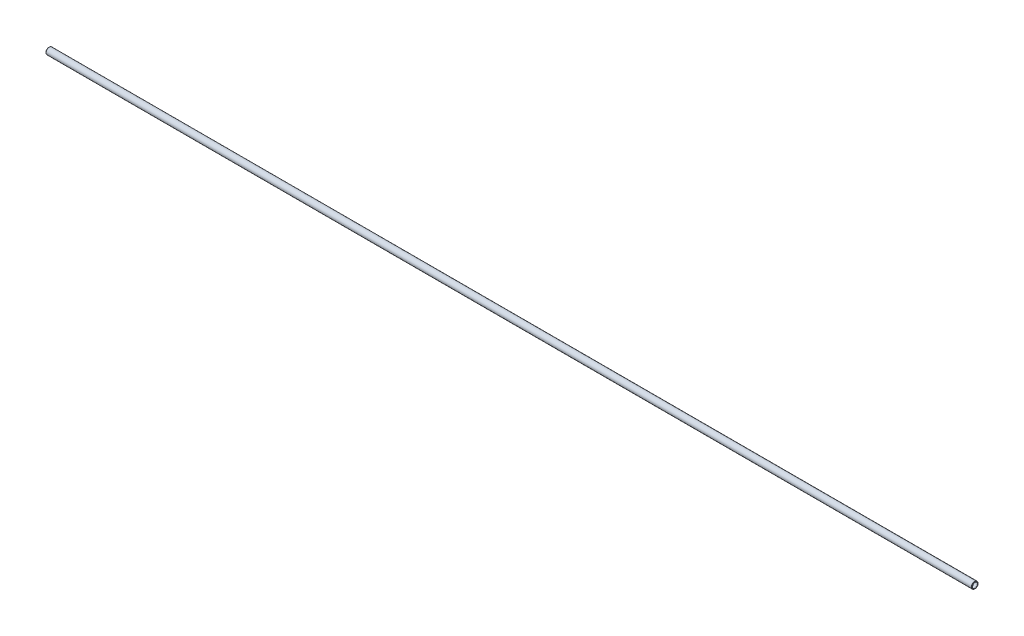
ISO-10303-21;
HEADER;
FILE_DESCRIPTION(('STEP AP214'),'2;1');
FILE_NAME('part.step','',(''),(''),'','','');
FILE_SCHEMA(('AUTOMOTIVE_DESIGN { 1 0 10303 214 1 1 1 1 }'));
ENDSEC;
DATA;
#1=APPLICATION_CONTEXT('core data for automotive mechanical design processes');
#2=APPLICATION_PROTOCOL_DEFINITION('international standard','automotive_design',2000,#1);
#3=PRODUCT_CONTEXT('',#1,'mechanical');
#4=PRODUCT('Part','Part','',(#3));
#5=PRODUCT_RELATED_PRODUCT_CATEGORY('part','',(#4));
#6=PRODUCT_DEFINITION_FORMATION('','',#4);
#7=PRODUCT_DEFINITION_CONTEXT('part definition',#1,'design');
#8=PRODUCT_DEFINITION('design','',#6,#7);
#9=PRODUCT_DEFINITION_SHAPE('','',#8);
#10=(LENGTH_UNIT() NAMED_UNIT(*) SI_UNIT(.MILLI.,.METRE.));
#11=(NAMED_UNIT(*) PLANE_ANGLE_UNIT() SI_UNIT($,.RADIAN.));
#12=(NAMED_UNIT(*) SI_UNIT($,.STERADIAN.) SOLID_ANGLE_UNIT());
#13=UNCERTAINTY_MEASURE_WITH_UNIT(LENGTH_MEASURE(1.E-05),#10,'distance_accuracy_value','');
#14=(GEOMETRIC_REPRESENTATION_CONTEXT(3) GLOBAL_UNCERTAINTY_ASSIGNED_CONTEXT((#13)) GLOBAL_UNIT_ASSIGNED_CONTEXT((#10,
#11,#12)) REPRESENTATION_CONTEXT('',''));
#15=CARTESIAN_POINT('',(0.,0.,0.));
#16=DIRECTION('',(0.,0.,1.));
#17=DIRECTION('',(1.,0.,0.));
#18=AXIS2_PLACEMENT_3D('',#15,#16,#17);
#19=CARTESIAN_POINT('',(-0.355226146905763,0.,0.));
#20=DIRECTION('',(-1.,0.,0.));
#21=DIRECTION('',(0.,0.,1.));
#22=AXIS2_PLACEMENT_3D('',#19,#20,#21);
#23=TOROIDAL_SURFACE('',#22,3.77968126932705,0.126999999999896);
#24=CARTESIAN_POINT('',(-0.445028708116357,0.,0.));
#25=DIRECTION('',(-1.,0.,0.));
#26=DIRECTION('',(0.,0.,1.));
#27=AXIS2_PLACEMENT_3D('',#24,#25,#26);
#28=CIRCLE('',#27,3.6898787081164);
#29=CARTESIAN_POINT('',(-0.445028708116357,0.,3.6898787081164));
#30=VERTEX_POINT('',#29);
#31=EDGE_CURVE('E10',#30,#30,#28,.T.);
#32=ORIENTED_EDGE('',*,*,#31,.F.);
#33=EDGE_LOOP('',(#32));
#34=FACE_BOUND('',#33,.T.);
#35=CARTESIAN_POINT('',(-0.445028708116357,0.,0.));
#36=DIRECTION('',(-1.,0.,0.));
#37=DIRECTION('',(0.,0.,1.));
#38=AXIS2_PLACEMENT_3D('',#35,#36,#37);
#39=CIRCLE('',#38,3.8694838305377);
#40=CARTESIAN_POINT('',(-0.445028708116357,0.,3.8694838305377));
#41=VERTEX_POINT('',#40);
#42=EDGE_CURVE('E79',#41,#41,#39,.T.);
#43=ORIENTED_EDGE('',*,*,#42,.T.);
#44=EDGE_LOOP('',(#43));
#45=FACE_BOUND('',#44,.T.);
#46=ADVANCED_FACE('F33',(#34,#45),#23,.T.);
#47=CARTESIAN_POINT('',(-0.445028708116357,0.,0.));
#48=DIRECTION('',(-1.,0.,0.));
#49=DIRECTION('',(0.,0.,1.));
#50=AXIS2_PLACEMENT_3D('',#47,#48,#49);
#51=CONICAL_SURFACE('',#50,3.6898787081164,0.785398163397365);
#52=CARTESIAN_POINT('',(-0.27939999999993,0.,0.));
#53=DIRECTION('',(-1.,0.,0.));
#54=DIRECTION('',(0.,0.,1.));
#55=AXIS2_PLACEMENT_3D('',#52,#53,#54);
#56=CIRCLE('',#55,3.52425);
#57=CARTESIAN_POINT('',(-0.27939999999993,0.,3.52425));
#58=VERTEX_POINT('',#57);
#59=EDGE_CURVE('E39',#58,#58,#56,.T.);
#60=ORIENTED_EDGE('',*,*,#59,.F.);
#61=EDGE_LOOP('',(#60));
#62=FACE_BOUND('',#61,.T.);
#63=ORIENTED_EDGE('',*,*,#31,.T.);
#64=EDGE_LOOP('',(#63));
#65=FACE_BOUND('',#64,.T.);
#66=ADVANCED_FACE('F152',(#62,#65),#51,.F.);
#67=CARTESIAN_POINT('',(1288.796,0.,0.));
#68=DIRECTION('',(-1.,0.,0.));
#69=DIRECTION('',(0.,0.,1.));
#70=AXIS2_PLACEMENT_3D('',#67,#68,#69);
#71=CYLINDRICAL_SURFACE('',#70,3.52425);
#72=CARTESIAN_POINT('',(0.,0.,0.));
#73=DIRECTION('',(-1.,0.,0.));
#74=DIRECTION('',(0.,0.,1.));
#75=AXIS2_PLACEMENT_3D('',#72,#73,#74);
#76=CIRCLE('',#75,3.52425);
#77=CARTESIAN_POINT('',(0.,0.,3.52425));
#78=VERTEX_POINT('',#77);
#79=EDGE_CURVE('E43',#78,#78,#76,.T.);
#80=ORIENTED_EDGE('',*,*,#79,.F.);
#81=EDGE_LOOP('',(#80));
#82=FACE_BOUND('',#81,.T.);
#83=ORIENTED_EDGE('',*,*,#59,.T.);
#84=EDGE_LOOP('',(#83));
#85=FACE_BOUND('',#84,.T.);
#86=ADVANCED_FACE('F147',(#82,#85),#71,.F.);
#87=CARTESIAN_POINT('',(0.,0.,0.));
#88=DIRECTION('',(1.,0.,0.));
#89=DIRECTION('',(0.,0.,-1.));
#90=AXIS2_PLACEMENT_3D('',#87,#88,#89);
#91=CONICAL_SURFACE('',#90,3.52425,0.785398163397376);
#92=CARTESIAN_POINT('',(0.558800000000081,0.,0.));
#93=DIRECTION('',(-1.,0.,0.));
#94=DIRECTION('',(0.,0.,1.));
#95=AXIS2_PLACEMENT_3D('',#92,#93,#94);
#96=CIRCLE('',#95,4.08305);
#97=CARTESIAN_POINT('',(0.558800000000081,0.,4.08305));
#98=VERTEX_POINT('',#97);
#99=EDGE_CURVE('E47',#98,#98,#96,.T.);
#100=ORIENTED_EDGE('',*,*,#99,.F.);
#101=EDGE_LOOP('',(#100));
#102=FACE_BOUND('',#101,.T.);
#103=ORIENTED_EDGE('',*,*,#79,.T.);
#104=EDGE_LOOP('',(#103));
#105=FACE_BOUND('',#104,.T.);
#106=ADVANCED_FACE('F141',(#102,#105),#91,.F.);
#107=CARTESIAN_POINT('',(1288.796,0.,0.));
#108=DIRECTION('',(-1.,0.,0.));
#109=DIRECTION('',(0.,0.,1.));
#110=AXIS2_PLACEMENT_3D('',#107,#108,#109);
#111=CYLINDRICAL_SURFACE('',#110,4.08305);
#112=CARTESIAN_POINT('',(1288.2372,0.,0.));
#113=DIRECTION('',(-1.,0.,0.));
#114=DIRECTION('',(0.,0.,1.));
#115=AXIS2_PLACEMENT_3D('',#112,#113,#114);
#116=CIRCLE('',#115,4.08305);
#117=CARTESIAN_POINT('',(1288.2372,0.,4.08305));
#118=VERTEX_POINT('',#117);
#119=EDGE_CURVE('E52',#118,#118,#116,.T.);
#120=ORIENTED_EDGE('',*,*,#119,.F.);
#121=EDGE_LOOP('',(#120));
#122=FACE_BOUND('',#121,.T.);
#123=ORIENTED_EDGE('',*,*,#99,.T.);
#124=EDGE_LOOP('',(#123));
#125=FACE_BOUND('',#124,.T.);
#126=ADVANCED_FACE('F135',(#122,#125),#111,.F.);
#127=CARTESIAN_POINT('',(1288.2372,0.,0.));
#128=DIRECTION('',(-1.,0.,0.));
#129=DIRECTION('',(0.,0.,1.));
#130=AXIS2_PLACEMENT_3D('',#127,#128,#129);
#131=CONICAL_SURFACE('',#130,4.08305,0.785398163397376);
#132=CARTESIAN_POINT('',(1288.796,0.,0.));
#133=DIRECTION('',(-1.,0.,0.));
#134=DIRECTION('',(0.,0.,1.));
#135=AXIS2_PLACEMENT_3D('',#132,#133,#134);
#136=CIRCLE('',#135,3.52425);
#137=CARTESIAN_POINT('',(1288.796,0.,3.52425));
#138=VERTEX_POINT('',#137);
#139=EDGE_CURVE('E55',#138,#138,#136,.T.);
#140=ORIENTED_EDGE('',*,*,#139,.F.);
#141=EDGE_LOOP('',(#140));
#142=FACE_BOUND('',#141,.T.);
#143=ORIENTED_EDGE('',*,*,#119,.T.);
#144=EDGE_LOOP('',(#143));
#145=FACE_BOUND('',#144,.T.);
#146=ADVANCED_FACE('F129',(#142,#145),#131,.F.);
#147=CARTESIAN_POINT('',(1288.796,0.,0.));
#148=DIRECTION('',(-1.,0.,0.));
#149=DIRECTION('',(0.,0.,1.));
#150=AXIS2_PLACEMENT_3D('',#147,#148,#149);
#151=CYLINDRICAL_SURFACE('',#150,3.52425);
#152=CARTESIAN_POINT('',(1289.0754,0.,0.));
#153=DIRECTION('',(-1.,0.,0.));
#154=DIRECTION('',(0.,0.,1.));
#155=AXIS2_PLACEMENT_3D('',#152,#153,#154);
#156=CIRCLE('',#155,3.52425);
#157=CARTESIAN_POINT('',(1289.0754,0.,3.52425));
#158=VERTEX_POINT('',#157);
#159=EDGE_CURVE('E58',#158,#158,#156,.T.);
#160=ORIENTED_EDGE('',*,*,#159,.F.);
#161=EDGE_LOOP('',(#160));
#162=FACE_BOUND('',#161,.T.);
#163=ORIENTED_EDGE('',*,*,#139,.T.);
#164=EDGE_LOOP('',(#163));
#165=FACE_BOUND('',#164,.T.);
#166=ADVANCED_FACE('F123',(#162,#165),#151,.F.);
#167=CARTESIAN_POINT('',(1289.0754,0.,0.));
#168=DIRECTION('',(1.,0.,0.));
#169=DIRECTION('',(0.,0.,-1.));
#170=AXIS2_PLACEMENT_3D('',#167,#168,#169);
#171=CONICAL_SURFACE('',#170,3.52425,0.785398163437878);
#172=CARTESIAN_POINT('',(1289.24102870811,0.,0.));
#173=DIRECTION('',(-1.,0.,0.));
#174=DIRECTION('',(0.,0.,1.));
#175=AXIS2_PLACEMENT_3D('',#172,#173,#174);
#176=CIRCLE('',#175,3.68987870812804);
#177=CARTESIAN_POINT('',(1289.24102870811,0.,3.68987870812804));
#178=VERTEX_POINT('',#177);
#179=EDGE_CURVE('E61',#178,#178,#176,.T.);
#180=ORIENTED_EDGE('',*,*,#179,.F.);
#181=EDGE_LOOP('',(#180));
#182=FACE_BOUND('',#181,.T.);
#183=ORIENTED_EDGE('',*,*,#159,.T.);
#184=EDGE_LOOP('',(#183));
#185=FACE_BOUND('',#184,.T.);
#186=ADVANCED_FACE('F117',(#182,#185),#171,.F.);
#187=CARTESIAN_POINT('',(1289.15122614693,0.,0.));
#188=DIRECTION('',(-1.,0.,0.));
#189=DIRECTION('',(0.,0.,1.));
#190=AXIS2_PLACEMENT_3D('',#187,#188,#189);
#191=TOROIDAL_SURFACE('',#190,3.77968126932705,0.126999999975991);
#192=CARTESIAN_POINT('',(1289.24102870812,0.,0.));
#193=DIRECTION('',(-1.,0.,0.));
#194=DIRECTION('',(0.,0.,1.));
#195=AXIS2_PLACEMENT_3D('',#192,#193,#194);
#196=CIRCLE('',#195,3.86948383050574);
#197=CARTESIAN_POINT('',(1289.24102870812,0.,3.86948383050574));
#198=VERTEX_POINT('',#197);
#199=EDGE_CURVE('E64',#198,#198,#196,.T.);
#200=ORIENTED_EDGE('',*,*,#199,.F.);
#201=EDGE_LOOP('',(#200));
#202=FACE_BOUND('',#201,.T.);
#203=ORIENTED_EDGE('',*,*,#179,.T.);
#204=EDGE_LOOP('',(#203));
#205=FACE_BOUND('',#204,.T.);
#206=ADVANCED_FACE('F111',(#202,#205),#191,.T.);
#207=CARTESIAN_POINT('',(1289.24102870812,0.,0.));
#208=DIRECTION('',(-1.,0.,0.));
#209=DIRECTION('',(0.,0.,1.));
#210=AXIS2_PLACEMENT_3D('',#207,#208,#209);
#211=CONICAL_SURFACE('',#210,3.86948383050574,0.785398163397545);
#212=CARTESIAN_POINT('',(1288.71488126927,0.,0.));
#213=DIRECTION('',(-1.,0.,0.));
#214=DIRECTION('',(0.,0.,1.));
#215=AXIS2_PLACEMENT_3D('',#212,#213,#214);
#216=CIRCLE('',#215,4.39563126935699);
#217=CARTESIAN_POINT('',(1288.71488126927,0.,4.39563126935699));
#218=VERTEX_POINT('',#217);
#219=EDGE_CURVE('E67',#218,#218,#216,.T.);
#220=ORIENTED_EDGE('',*,*,#219,.F.);
#221=EDGE_LOOP('',(#220));
#222=FACE_BOUND('',#221,.T.);
#223=ORIENTED_EDGE('',*,*,#199,.T.);
#224=EDGE_LOOP('',(#223));
#225=FACE_BOUND('',#224,.T.);
#226=ADVANCED_FACE('F105',(#222,#225),#211,.T.);
#227=CARTESIAN_POINT('',(1288.31975000001,0.,0.));
#228=DIRECTION('',(-1.,0.,0.));
#229=DIRECTION('',(0.,0.,1.));
#230=AXIS2_PLACEMENT_3D('',#227,#228,#229);
#231=TOROIDAL_SURFACE('',#230,4.00050000010169,0.558799999898457);
#232=CARTESIAN_POINT('',(1288.31975000001,0.,0.));
#233=DIRECTION('',(-1.,0.,0.));
#234=DIRECTION('',(0.,0.,1.));
#235=AXIS2_PLACEMENT_3D('',#232,#233,#234);
#236=CIRCLE('',#235,4.55930000000016);
#237=CARTESIAN_POINT('',(1288.31975000001,0.,4.55930000000016));
#238=VERTEX_POINT('',#237);
#239=EDGE_CURVE('E70',#238,#238,#236,.T.);
#240=ORIENTED_EDGE('',*,*,#239,.F.);
#241=EDGE_LOOP('',(#240));
#242=FACE_BOUND('',#241,.T.);
#243=ORIENTED_EDGE('',*,*,#219,.T.);
#244=EDGE_LOOP('',(#243));
#245=FACE_BOUND('',#244,.T.);
#246=ADVANCED_FACE('F99',(#242,#245),#231,.T.);
#247=CARTESIAN_POINT('',(1288.796,0.,0.));
#248=DIRECTION('',(-1.,0.,0.));
#249=DIRECTION('',(0.,0.,1.));
#250=AXIS2_PLACEMENT_3D('',#247,#248,#249);
#251=CYLINDRICAL_SURFACE('',#250,4.55930000000008);
#252=CARTESIAN_POINT('',(0.476249999999956,0.,0.));
#253=DIRECTION('',(-1.,0.,0.));
#254=DIRECTION('',(0.,0.,1.));
#255=AXIS2_PLACEMENT_3D('',#252,#253,#254);
#256=CIRCLE('',#255,4.5593);
#257=CARTESIAN_POINT('',(0.476249999999956,0.,4.5593));
#258=VERTEX_POINT('',#257);
#259=EDGE_CURVE('E73',#258,#258,#256,.T.);
#260=ORIENTED_EDGE('',*,*,#259,.F.);
#261=EDGE_LOOP('',(#260));
#262=FACE_BOUND('',#261,.T.);
#263=ORIENTED_EDGE('',*,*,#239,.T.);
#264=EDGE_LOOP('',(#263));
#265=FACE_BOUND('',#264,.T.);
#266=ADVANCED_FACE('F93',(#262,#265),#251,.T.);
#267=CARTESIAN_POINT('',(0.476250000000095,0.,0.));
#268=DIRECTION('',(-1.,0.,0.));
#269=DIRECTION('',(0.,0.,1.));
#270=AXIS2_PLACEMENT_3D('',#267,#268,#269);
#271=TOROIDAL_SURFACE('',#270,4.00049999999988,0.558800000000125);
#272=CARTESIAN_POINT('',(0.0811187306728467,0.,0.));
#273=DIRECTION('',(-1.,0.,0.));
#274=DIRECTION('',(0.,0.,1.));
#275=AXIS2_PLACEMENT_3D('',#272,#273,#274);
#276=CIRCLE('',#275,4.395631269327);
#277=CARTESIAN_POINT('',(0.0811187306728467,0.,4.395631269327));
#278=VERTEX_POINT('',#277);
#279=EDGE_CURVE('E76',#278,#278,#276,.T.);
#280=ORIENTED_EDGE('',*,*,#279,.F.);
#281=EDGE_LOOP('',(#280));
#282=FACE_BOUND('',#281,.T.);
#283=ORIENTED_EDGE('',*,*,#259,.T.);
#284=EDGE_LOOP('',(#283));
#285=FACE_BOUND('',#284,.T.);
#286=ADVANCED_FACE('F87',(#282,#285),#271,.T.);
#287=CARTESIAN_POINT('',(0.0811187306728467,0.,0.));
#288=DIRECTION('',(1.,0.,0.));
#289=DIRECTION('',(0.,0.,-1.));
#290=AXIS2_PLACEMENT_3D('',#287,#288,#289);
#291=CONICAL_SURFACE('',#290,4.395631269327,0.785398163397539);
#292=ORIENTED_EDGE('',*,*,#42,.F.);
#293=EDGE_LOOP('',(#292));
#294=FACE_BOUND('',#293,.T.);
#295=ORIENTED_EDGE('',*,*,#279,.T.);
#296=EDGE_LOOP('',(#295));
#297=FACE_BOUND('',#296,.T.);
#298=ADVANCED_FACE('F84',(#294,#297),#291,.T.);
#299=CLOSED_SHELL('',(#46,#66,#86,#106,#126,#146,#166,#186,#206,#226,#246,#266,#286,#298));
#300=MANIFOLD_SOLID_BREP('B2',#299);
#301=ADVANCED_BREP_SHAPE_REPRESENTATION('',(#18,#300),#14);
#302=SHAPE_DEFINITION_REPRESENTATION(#9,#301);
ENDSEC;
END-ISO-10303-21;
